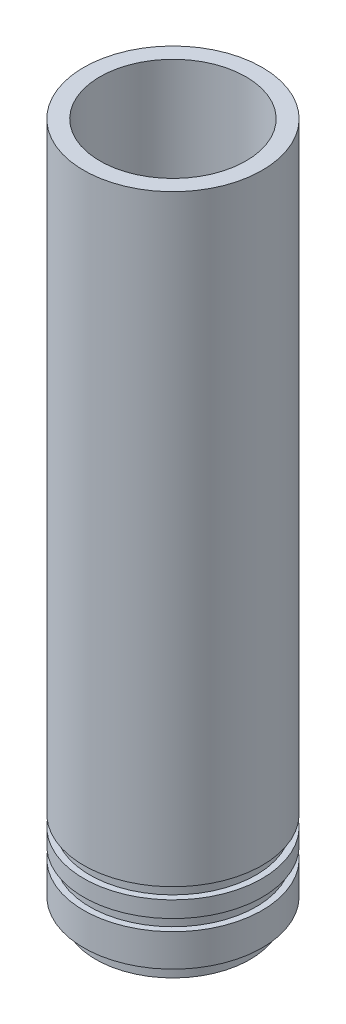
ISO-10303-21;
HEADER;
FILE_DESCRIPTION(('STEP AP214'),'2;1');
FILE_NAME('part.step','',(''),(''),'','','');
FILE_SCHEMA(('AUTOMOTIVE_DESIGN { 1 0 10303 214 1 1 1 1 }'));
ENDSEC;
DATA;
#1=APPLICATION_CONTEXT('core data for automotive mechanical design processes');
#2=APPLICATION_PROTOCOL_DEFINITION('international standard','automotive_design',2000,#1);
#3=PRODUCT_CONTEXT('',#1,'mechanical');
#4=PRODUCT('Part','Part','',(#3));
#5=PRODUCT_RELATED_PRODUCT_CATEGORY('part','',(#4));
#6=PRODUCT_DEFINITION_FORMATION('','',#4);
#7=PRODUCT_DEFINITION_CONTEXT('part definition',#1,'design');
#8=PRODUCT_DEFINITION('design','',#6,#7);
#9=PRODUCT_DEFINITION_SHAPE('','',#8);
#10=(LENGTH_UNIT() NAMED_UNIT(*) SI_UNIT(.MILLI.,.METRE.));
#11=(NAMED_UNIT(*) PLANE_ANGLE_UNIT() SI_UNIT($,.RADIAN.));
#12=(NAMED_UNIT(*) SI_UNIT($,.STERADIAN.) SOLID_ANGLE_UNIT());
#13=UNCERTAINTY_MEASURE_WITH_UNIT(LENGTH_MEASURE(1.E-05),#10,'distance_accuracy_value','');
#14=(GEOMETRIC_REPRESENTATION_CONTEXT(3) GLOBAL_UNCERTAINTY_ASSIGNED_CONTEXT((#13)) GLOBAL_UNIT_ASSIGNED_CONTEXT((#10,
#11,#12)) REPRESENTATION_CONTEXT('',''));
#15=CARTESIAN_POINT('',(0.,0.,0.));
#16=DIRECTION('',(0.,0.,1.));
#17=DIRECTION('',(1.,0.,0.));
#18=AXIS2_PLACEMENT_3D('',#15,#16,#17);
#19=CARTESIAN_POINT('',(19.,0.,0.));
#20=DIRECTION('',(0.,-1.,0.));
#21=DIRECTION('',(0.,0.,-1.));
#22=AXIS2_PLACEMENT_3D('',#19,#20,#21);
#23=PLANE('',#22);
#24=CARTESIAN_POINT('',(0.,0.,0.));
#25=DIRECTION('',(0.,-1.,0.));
#26=DIRECTION('',(0.,0.,-1.));
#27=AXIS2_PLACEMENT_3D('',#24,#25,#26);
#28=CIRCLE('',#27,19.);
#29=CARTESIAN_POINT('',(0.,0.,-19.));
#30=VERTEX_POINT('',#29);
#31=EDGE_CURVE('E94',#30,#30,#28,.T.);
#32=ORIENTED_EDGE('',*,*,#31,.T.);
#33=EDGE_LOOP('',(#32));
#34=FACE_BOUND('',#33,.T.);
#35=CARTESIAN_POINT('',(0.,0.,0.));
#36=DIRECTION('',(0.,-1.,0.));
#37=DIRECTION('',(0.,0.,-1.));
#38=AXIS2_PLACEMENT_3D('',#35,#36,#37);
#39=CIRCLE('',#38,16.);
#40=CARTESIAN_POINT('',(0.,0.,-16.));
#41=VERTEX_POINT('',#40);
#42=EDGE_CURVE('E52',#41,#41,#39,.T.);
#43=ORIENTED_EDGE('',*,*,#42,.F.);
#44=EDGE_LOOP('',(#43));
#45=FACE_BOUND('',#44,.T.);
#46=ADVANCED_FACE('F32',(#34,#45),#23,.T.);
#47=CARTESIAN_POINT('',(0.,24.2583302491976,0.));
#48=DIRECTION('',(0.,-1.,0.));
#49=DIRECTION('',(0.,0.,-1.));
#50=AXIS2_PLACEMENT_3D('',#47,#48,#49);
#51=CONICAL_SURFACE('',#50,9.5,0.26179938779915);
#52=CARTESIAN_POINT('',(0.,23.622497511622,0.));
#53=DIRECTION('',(0.,1.,0.));
#54=DIRECTION('',(0.,0.,1.));
#55=AXIS2_PLACEMENT_3D('',#52,#53,#54);
#56=CIRCLE('',#55,9.67037086855466);
#57=CARTESIAN_POINT('',(0.,23.622497511622,9.67037086855466));
#58=VERTEX_POINT('',#57);
#59=EDGE_CURVE('E10',#58,#58,#56,.T.);
#60=ORIENTED_EDGE('',*,*,#59,.T.);
#61=EDGE_LOOP('',(#60));
#62=FACE_BOUND('',#61,.T.);
#63=ORIENTED_EDGE('',*,*,#42,.T.);
#64=EDGE_LOOP('',(#63));
#65=FACE_BOUND('',#64,.T.);
#66=ADVANCED_FACE('F115',(#62,#65),#51,.F.);
#67=CARTESIAN_POINT('',(0.,0.,0.));
#68=DIRECTION('',(0.,-1.,0.));
#69=DIRECTION('',(0.,0.,-1.));
#70=AXIS2_PLACEMENT_3D('',#67,#68,#69);
#71=CYLINDRICAL_SURFACE('',#70,9.5);
#72=CARTESIAN_POINT('',(0.,27.1872624373321,0.));
#73=DIRECTION('',(0.,1.,0.));
#74=DIRECTION('',(0.,0.,1.));
#75=AXIS2_PLACEMENT_3D('',#72,#73,#74);
#76=CIRCLE('',#75,9.5);
#77=CARTESIAN_POINT('',(0.,27.1872624373321,9.5));
#78=VERTEX_POINT('',#77);
#79=EDGE_CURVE('E39',#78,#78,#76,.T.);
#80=ORIENTED_EDGE('',*,*,#79,.T.);
#81=EDGE_LOOP('',(#80));
#82=FACE_BOUND('',#81,.T.);
#83=CARTESIAN_POINT('',(0.,24.9165927371346,0.));
#84=DIRECTION('',(0.,1.,0.));
#85=DIRECTION('',(0.,0.,1.));
#86=AXIS2_PLACEMENT_3D('',#83,#84,#85);
#87=CIRCLE('',#86,9.5);
#88=CARTESIAN_POINT('',(0.,24.9165927371346,9.5));
#89=VERTEX_POINT('',#88);
#90=EDGE_CURVE('E43',#89,#89,#87,.F.);
#91=ORIENTED_EDGE('',*,*,#90,.T.);
#92=EDGE_LOOP('',(#91));
#93=FACE_BOUND('',#92,.T.);
#94=ADVANCED_FACE('F120',(#82,#93),#71,.F.);
#95=CARTESIAN_POINT('',(0.,37.7583302491976,0.));
#96=DIRECTION('',(0.,1.,0.));
#97=DIRECTION('',(0.,0.,1.));
#98=AXIS2_PLACEMENT_3D('',#95,#96,#97);
#99=CONICAL_SURFACE('',#98,18.,0.78539816339745);
#100=CARTESIAN_POINT('',(0.,30.7227963432649,0.));
#101=DIRECTION('',(0.,-1.,0.));
#102=DIRECTION('',(0.,0.,-1.));
#103=AXIS2_PLACEMENT_3D('',#100,#101,#102);
#104=CIRCLE('',#103,10.9644660940673);
#105=CARTESIAN_POINT('',(0.,30.7227963432649,-10.9644660940673));
#106=VERTEX_POINT('',#105);
#107=EDGE_CURVE('E47',#106,#106,#104,.T.);
#108=ORIENTED_EDGE('',*,*,#107,.T.);
#109=EDGE_LOOP('',(#108));
#110=FACE_BOUND('',#109,.T.);
#111=CARTESIAN_POINT('',(0.,37.7583302491976,0.));
#112=DIRECTION('',(0.,-1.,0.));
#113=DIRECTION('',(0.,0.,-1.));
#114=AXIS2_PLACEMENT_3D('',#111,#112,#113);
#115=CIRCLE('',#114,18.);
#116=CARTESIAN_POINT('',(0.,37.7583302491976,-18.));
#117=VERTEX_POINT('',#116);
#118=EDGE_CURVE('E55',#117,#117,#115,.T.);
#119=ORIENTED_EDGE('',*,*,#118,.F.);
#120=EDGE_LOOP('',(#119));
#121=FACE_BOUND('',#120,.T.);
#122=ADVANCED_FACE('F125',(#110,#121),#99,.F.);
#123=CARTESIAN_POINT('',(0.,0.,0.));
#124=DIRECTION('',(0.,-1.,0.));
#125=DIRECTION('',(0.,0.,-1.));
#126=AXIS2_PLACEMENT_3D('',#123,#124,#125);
#127=CYLINDRICAL_SURFACE('',#126,18.);
#128=ORIENTED_EDGE('',*,*,#118,.T.);
#129=EDGE_LOOP('',(#128));
#130=FACE_BOUND('',#129,.T.);
#131=CARTESIAN_POINT('',(0.,170.,0.));
#132=DIRECTION('',(0.,-1.,0.));
#133=DIRECTION('',(0.,0.,-1.));
#134=AXIS2_PLACEMENT_3D('',#131,#132,#133);
#135=CIRCLE('',#134,18.);
#136=CARTESIAN_POINT('',(0.,170.,-18.));
#137=VERTEX_POINT('',#136);
#138=EDGE_CURVE('E58',#137,#137,#135,.T.);
#139=ORIENTED_EDGE('',*,*,#138,.F.);
#140=EDGE_LOOP('',(#139));
#141=FACE_BOUND('',#140,.T.);
#142=ADVANCED_FACE('F128',(#130,#141),#127,.F.);
#143=CARTESIAN_POINT('',(18.,170.,0.));
#144=DIRECTION('',(0.,1.,0.));
#145=DIRECTION('',(0.,0.,1.));
#146=AXIS2_PLACEMENT_3D('',#143,#144,#145);
#147=PLANE('',#146);
#148=ORIENTED_EDGE('',*,*,#138,.T.);
#149=EDGE_LOOP('',(#148));
#150=FACE_BOUND('',#149,.T.);
#151=CARTESIAN_POINT('',(0.,170.,0.));
#152=DIRECTION('',(0.,-1.,0.));
#153=DIRECTION('',(0.,0.,-1.));
#154=AXIS2_PLACEMENT_3D('',#151,#152,#153);
#155=CIRCLE('',#154,22.);
#156=CARTESIAN_POINT('',(0.,170.,-22.));
#157=VERTEX_POINT('',#156);
#158=EDGE_CURVE('E61',#157,#157,#155,.T.);
#159=ORIENTED_EDGE('',*,*,#158,.F.);
#160=EDGE_LOOP('',(#159));
#161=FACE_BOUND('',#160,.T.);
#162=ADVANCED_FACE('F132',(#150,#161),#147,.T.);
#163=CARTESIAN_POINT('',(0.,0.,0.));
#164=DIRECTION('',(0.,-1.,0.));
#165=DIRECTION('',(0.,0.,-1.));
#166=AXIS2_PLACEMENT_3D('',#163,#164,#165);
#167=CYLINDRICAL_SURFACE('',#166,22.);
#168=ORIENTED_EDGE('',*,*,#158,.T.);
#169=EDGE_LOOP('',(#168));
#170=FACE_BOUND('',#169,.T.);
#171=CARTESIAN_POINT('',(0.,21.6,0.));
#172=DIRECTION('',(0.,-1.,0.));
#173=DIRECTION('',(0.,0.,-1.));
#174=AXIS2_PLACEMENT_3D('',#171,#172,#173);
#175=CIRCLE('',#174,22.);
#176=CARTESIAN_POINT('',(0.,21.6,-22.));
#177=VERTEX_POINT('',#176);
#178=EDGE_CURVE('E64',#177,#177,#175,.T.);
#179=ORIENTED_EDGE('',*,*,#178,.F.);
#180=EDGE_LOOP('',(#179));
#181=FACE_BOUND('',#180,.T.);
#182=ADVANCED_FACE('F136',(#170,#181),#167,.T.);
#183=CARTESIAN_POINT('',(22.,21.6,0.));
#184=DIRECTION('',(0.,-1.,0.));
#185=DIRECTION('',(0.,0.,-1.));
#186=AXIS2_PLACEMENT_3D('',#183,#184,#185);
#187=PLANE('',#186);
#188=ORIENTED_EDGE('',*,*,#178,.T.);
#189=EDGE_LOOP('',(#188));
#190=FACE_BOUND('',#189,.T.);
#191=CARTESIAN_POINT('',(0.,21.6,0.));
#192=DIRECTION('',(0.,-1.,0.));
#193=DIRECTION('',(0.,0.,-1.));
#194=AXIS2_PLACEMENT_3D('',#191,#192,#193);
#195=CIRCLE('',#194,20.5);
#196=CARTESIAN_POINT('',(0.,21.6,-20.5));
#197=VERTEX_POINT('',#196);
#198=EDGE_CURVE('E67',#197,#197,#195,.T.);
#199=ORIENTED_EDGE('',*,*,#198,.F.);
#200=EDGE_LOOP('',(#199));
#201=FACE_BOUND('',#200,.T.);
#202=ADVANCED_FACE('F140',(#190,#201),#187,.T.);
#203=CARTESIAN_POINT('',(0.,0.,0.));
#204=DIRECTION('',(0.,-1.,0.));
#205=DIRECTION('',(0.,0.,-1.));
#206=AXIS2_PLACEMENT_3D('',#203,#204,#205);
#207=CYLINDRICAL_SURFACE('',#206,20.5);
#208=ORIENTED_EDGE('',*,*,#198,.T.);
#209=EDGE_LOOP('',(#208));
#210=FACE_BOUND('',#209,.T.);
#211=CARTESIAN_POINT('',(0.,18.8,0.));
#212=DIRECTION('',(0.,-1.,0.));
#213=DIRECTION('',(0.,0.,-1.));
#214=AXIS2_PLACEMENT_3D('',#211,#212,#213);
#215=CIRCLE('',#214,20.5);
#216=CARTESIAN_POINT('',(0.,18.8,-20.5));
#217=VERTEX_POINT('',#216);
#218=EDGE_CURVE('E70',#217,#217,#215,.T.);
#219=ORIENTED_EDGE('',*,*,#218,.F.);
#220=EDGE_LOOP('',(#219));
#221=FACE_BOUND('',#220,.T.);
#222=ADVANCED_FACE('F144',(#210,#221),#207,.T.);
#223=CARTESIAN_POINT('',(20.5,18.8,0.));
#224=DIRECTION('',(0.,1.,0.));
#225=DIRECTION('',(0.,0.,1.));
#226=AXIS2_PLACEMENT_3D('',#223,#224,#225);
#227=PLANE('',#226);
#228=ORIENTED_EDGE('',*,*,#218,.T.);
#229=EDGE_LOOP('',(#228));
#230=FACE_BOUND('',#229,.T.);
#231=CARTESIAN_POINT('',(0.,18.8,0.));
#232=DIRECTION('',(0.,-1.,0.));
#233=DIRECTION('',(0.,0.,-1.));
#234=AXIS2_PLACEMENT_3D('',#231,#232,#233);
#235=CIRCLE('',#234,22.);
#236=CARTESIAN_POINT('',(0.,18.8,-22.));
#237=VERTEX_POINT('',#236);
#238=EDGE_CURVE('E73',#237,#237,#235,.T.);
#239=ORIENTED_EDGE('',*,*,#238,.F.);
#240=EDGE_LOOP('',(#239));
#241=FACE_BOUND('',#240,.T.);
#242=ADVANCED_FACE('F148',(#230,#241),#227,.T.);
#243=CARTESIAN_POINT('',(0.,0.,0.));
#244=DIRECTION('',(0.,-1.,0.));
#245=DIRECTION('',(0.,0.,-1.));
#246=AXIS2_PLACEMENT_3D('',#243,#244,#245);
#247=CYLINDRICAL_SURFACE('',#246,22.);
#248=ORIENTED_EDGE('',*,*,#238,.T.);
#249=EDGE_LOOP('',(#248));
#250=FACE_BOUND('',#249,.T.);
#251=CARTESIAN_POINT('',(0.,14.8,0.));
#252=DIRECTION('',(0.,-1.,0.));
#253=DIRECTION('',(0.,0.,-1.));
#254=AXIS2_PLACEMENT_3D('',#251,#252,#253);
#255=CIRCLE('',#254,22.);
#256=CARTESIAN_POINT('',(0.,14.8,-22.));
#257=VERTEX_POINT('',#256);
#258=EDGE_CURVE('E76',#257,#257,#255,.T.);
#259=ORIENTED_EDGE('',*,*,#258,.F.);
#260=EDGE_LOOP('',(#259));
#261=FACE_BOUND('',#260,.T.);
#262=ADVANCED_FACE('F152',(#250,#261),#247,.T.);
#263=CARTESIAN_POINT('',(22.,14.8,0.));
#264=DIRECTION('',(0.,-1.,0.));
#265=DIRECTION('',(0.,0.,-1.));
#266=AXIS2_PLACEMENT_3D('',#263,#264,#265);
#267=PLANE('',#266);
#268=ORIENTED_EDGE('',*,*,#258,.T.);
#269=EDGE_LOOP('',(#268));
#270=FACE_BOUND('',#269,.T.);
#271=CARTESIAN_POINT('',(0.,14.8,0.));
#272=DIRECTION('',(0.,-1.,0.));
#273=DIRECTION('',(0.,0.,-1.));
#274=AXIS2_PLACEMENT_3D('',#271,#272,#273);
#275=CIRCLE('',#274,20.5);
#276=CARTESIAN_POINT('',(0.,14.8,-20.5));
#277=VERTEX_POINT('',#276);
#278=EDGE_CURVE('E79',#277,#277,#275,.T.);
#279=ORIENTED_EDGE('',*,*,#278,.F.);
#280=EDGE_LOOP('',(#279));
#281=FACE_BOUND('',#280,.T.);
#282=ADVANCED_FACE('F156',(#270,#281),#267,.T.);
#283=CARTESIAN_POINT('',(0.,0.,0.));
#284=DIRECTION('',(0.,-1.,0.));
#285=DIRECTION('',(0.,0.,-1.));
#286=AXIS2_PLACEMENT_3D('',#283,#284,#285);
#287=CYLINDRICAL_SURFACE('',#286,20.5);
#288=ORIENTED_EDGE('',*,*,#278,.T.);
#289=EDGE_LOOP('',(#288));
#290=FACE_BOUND('',#289,.T.);
#291=CARTESIAN_POINT('',(0.,12.,0.));
#292=DIRECTION('',(0.,-1.,0.));
#293=DIRECTION('',(0.,0.,-1.));
#294=AXIS2_PLACEMENT_3D('',#291,#292,#293);
#295=CIRCLE('',#294,20.5);
#296=CARTESIAN_POINT('',(0.,12.,-20.5));
#297=VERTEX_POINT('',#296);
#298=EDGE_CURVE('E82',#297,#297,#295,.T.);
#299=ORIENTED_EDGE('',*,*,#298,.F.);
#300=EDGE_LOOP('',(#299));
#301=FACE_BOUND('',#300,.T.);
#302=ADVANCED_FACE('F160',(#290,#301),#287,.T.);
#303=CARTESIAN_POINT('',(20.5,12.,0.));
#304=DIRECTION('',(0.,1.,0.));
#305=DIRECTION('',(0.,0.,1.));
#306=AXIS2_PLACEMENT_3D('',#303,#304,#305);
#307=PLANE('',#306);
#308=ORIENTED_EDGE('',*,*,#298,.T.);
#309=EDGE_LOOP('',(#308));
#310=FACE_BOUND('',#309,.T.);
#311=CARTESIAN_POINT('',(0.,12.,0.));
#312=DIRECTION('',(0.,-1.,0.));
#313=DIRECTION('',(0.,0.,-1.));
#314=AXIS2_PLACEMENT_3D('',#311,#312,#313);
#315=CIRCLE('',#314,22.);
#316=CARTESIAN_POINT('',(0.,12.,-22.));
#317=VERTEX_POINT('',#316);
#318=EDGE_CURVE('E85',#317,#317,#315,.T.);
#319=ORIENTED_EDGE('',*,*,#318,.F.);
#320=EDGE_LOOP('',(#319));
#321=FACE_BOUND('',#320,.T.);
#322=ADVANCED_FACE('F164',(#310,#321),#307,.T.);
#323=CARTESIAN_POINT('',(0.,0.,0.));
#324=DIRECTION('',(0.,-1.,0.));
#325=DIRECTION('',(0.,0.,-1.));
#326=AXIS2_PLACEMENT_3D('',#323,#324,#325);
#327=CYLINDRICAL_SURFACE('',#326,22.);
#328=ORIENTED_EDGE('',*,*,#318,.T.);
#329=EDGE_LOOP('',(#328));
#330=FACE_BOUND('',#329,.T.);
#331=CARTESIAN_POINT('',(0.,4.,0.));
#332=DIRECTION('',(0.,-1.,0.));
#333=DIRECTION('',(0.,0.,-1.));
#334=AXIS2_PLACEMENT_3D('',#331,#332,#333);
#335=CIRCLE('',#334,22.);
#336=CARTESIAN_POINT('',(0.,4.,-22.));
#337=VERTEX_POINT('',#336);
#338=EDGE_CURVE('E88',#337,#337,#335,.T.);
#339=ORIENTED_EDGE('',*,*,#338,.F.);
#340=EDGE_LOOP('',(#339));
#341=FACE_BOUND('',#340,.T.);
#342=ADVANCED_FACE('F111',(#330,#341),#327,.T.);
#343=CARTESIAN_POINT('',(22.,4.,0.));
#344=DIRECTION('',(0.,-1.,0.));
#345=DIRECTION('',(0.,0.,-1.));
#346=AXIS2_PLACEMENT_3D('',#343,#344,#345);
#347=PLANE('',#346);
#348=ORIENTED_EDGE('',*,*,#338,.T.);
#349=EDGE_LOOP('',(#348));
#350=FACE_BOUND('',#349,.T.);
#351=CARTESIAN_POINT('',(0.,4.,0.));
#352=DIRECTION('',(0.,-1.,0.));
#353=DIRECTION('',(0.,0.,-1.));
#354=AXIS2_PLACEMENT_3D('',#351,#352,#353);
#355=CIRCLE('',#354,19.);
#356=CARTESIAN_POINT('',(0.,4.,-19.));
#357=VERTEX_POINT('',#356);
#358=EDGE_CURVE('E91',#357,#357,#355,.T.);
#359=ORIENTED_EDGE('',*,*,#358,.F.);
#360=EDGE_LOOP('',(#359));
#361=FACE_BOUND('',#360,.T.);
#362=ADVANCED_FACE('F103',(#350,#361),#347,.T.);
#363=CARTESIAN_POINT('',(0.,0.,0.));
#364=DIRECTION('',(0.,-1.,0.));
#365=DIRECTION('',(0.,0.,-1.));
#366=AXIS2_PLACEMENT_3D('',#363,#364,#365);
#367=CYLINDRICAL_SURFACE('',#366,19.);
#368=ORIENTED_EDGE('',*,*,#358,.T.);
#369=EDGE_LOOP('',(#368));
#370=FACE_BOUND('',#369,.T.);
#371=ORIENTED_EDGE('',*,*,#31,.F.);
#372=EDGE_LOOP('',(#371));
#373=FACE_BOUND('',#372,.T.);
#374=ADVANCED_FACE('F100',(#370,#373),#367,.T.);
#375=CARTESIAN_POINT('',(0.,27.1872624373321,0.));
#376=DIRECTION('',(0.,1.,0.));
#377=DIRECTION('',(0.,0.,1.));
#378=AXIS2_PLACEMENT_3D('',#375,#376,#377);
#379=TOROIDAL_SURFACE('',#378,14.5,5.);
#380=ORIENTED_EDGE('',*,*,#79,.F.);
#381=EDGE_LOOP('',(#380));
#382=FACE_BOUND('',#381,.T.);
#383=ORIENTED_EDGE('',*,*,#107,.F.);
#384=EDGE_LOOP('',(#383));
#385=FACE_BOUND('',#384,.T.);
#386=ADVANCED_FACE('F102',(#382,#385),#379,.T.);
#387=CARTESIAN_POINT('',(0.,24.9165927371346,0.));
#388=DIRECTION('',(0.,1.,0.));
#389=DIRECTION('',(0.,0.,1.));
#390=AXIS2_PLACEMENT_3D('',#387,#388,#389);
#391=TOROIDAL_SURFACE('',#390,14.5,5.);
#392=ORIENTED_EDGE('',*,*,#59,.F.);
#393=EDGE_LOOP('',(#392));
#394=FACE_BOUND('',#393,.T.);
#395=ORIENTED_EDGE('',*,*,#90,.F.);
#396=EDGE_LOOP('',(#395));
#397=FACE_BOUND('',#396,.T.);
#398=ADVANCED_FACE('F34',(#394,#397),#391,.T.);
#399=CLOSED_SHELL('',(#46,#66,#94,#122,#142,#162,#182,#202,#222,#242,#262,#282,#302,#322,#342,
#362,#374,#386,#398));
#400=MANIFOLD_SOLID_BREP('B2',#399);
#401=ADVANCED_BREP_SHAPE_REPRESENTATION('',(#18,#400),#14);
#402=SHAPE_DEFINITION_REPRESENTATION(#9,#401);
ENDSEC;
END-ISO-10303-21;
